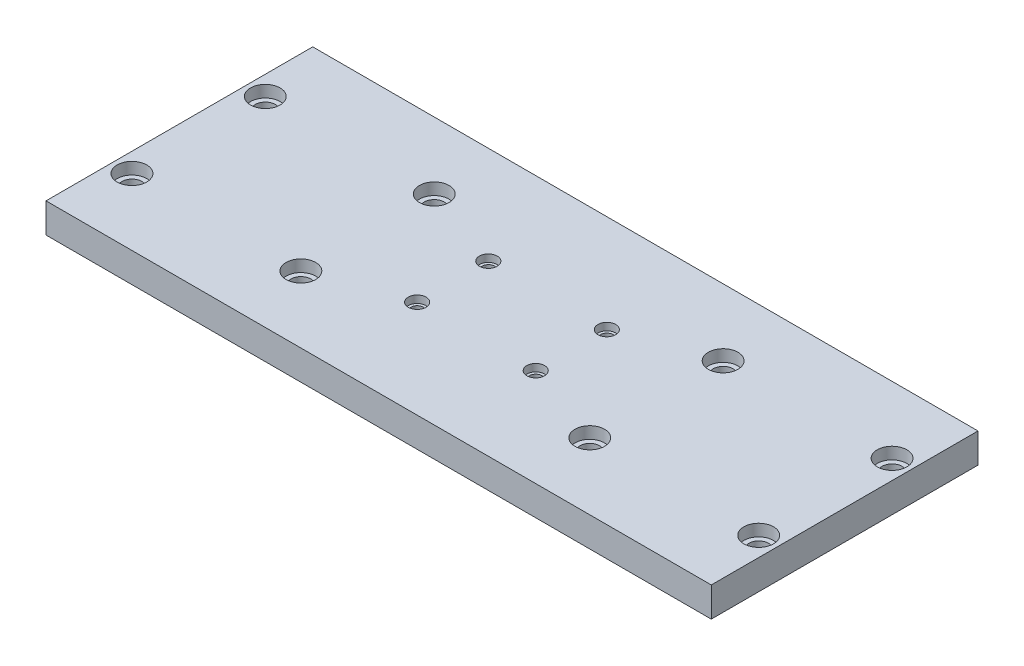
ISO-10303-21;
HEADER;
FILE_DESCRIPTION(('STEP AP214'),'2;1');
FILE_NAME('part.step','',(''),(''),'','','');
FILE_SCHEMA(('AUTOMOTIVE_DESIGN { 1 0 10303 214 1 1 1 1 }'));
ENDSEC;
DATA;
#1=APPLICATION_CONTEXT('core data for automotive mechanical design processes');
#2=APPLICATION_PROTOCOL_DEFINITION('international standard','automotive_design',2000,#1);
#3=PRODUCT_CONTEXT('',#1,'mechanical');
#4=PRODUCT('Part','Part','',(#3));
#5=PRODUCT_RELATED_PRODUCT_CATEGORY('part','',(#4));
#6=PRODUCT_DEFINITION_FORMATION('','',#4);
#7=PRODUCT_DEFINITION_CONTEXT('part definition',#1,'design');
#8=PRODUCT_DEFINITION('design','',#6,#7);
#9=PRODUCT_DEFINITION_SHAPE('','',#8);
#10=(LENGTH_UNIT() NAMED_UNIT(*) SI_UNIT(.MILLI.,.METRE.));
#11=(NAMED_UNIT(*) PLANE_ANGLE_UNIT() SI_UNIT($,.RADIAN.));
#12=(NAMED_UNIT(*) SI_UNIT($,.STERADIAN.) SOLID_ANGLE_UNIT());
#13=UNCERTAINTY_MEASURE_WITH_UNIT(LENGTH_MEASURE(1.E-05),#10,'distance_accuracy_value','');
#14=(GEOMETRIC_REPRESENTATION_CONTEXT(3) GLOBAL_UNCERTAINTY_ASSIGNED_CONTEXT((#13)) GLOBAL_UNIT_ASSIGNED_CONTEXT((#10,
#11,#12)) REPRESENTATION_CONTEXT('',''));
#15=CARTESIAN_POINT('',(0.,0.,0.));
#16=DIRECTION('',(0.,0.,1.));
#17=DIRECTION('',(1.,0.,0.));
#18=AXIS2_PLACEMENT_3D('',#15,#16,#17);
#19=CARTESIAN_POINT('',(-48.7399999999999,0.,-22.5));
#20=DIRECTION('',(0.,1.,0.));
#21=DIRECTION('',(0.,0.,1.));
#22=AXIS2_PLACEMENT_3D('',#19,#20,#21);
#23=CYLINDRICAL_SURFACE('',#22,3.35);
#24=CARTESIAN_POINT('',(-48.7399999999999,0.,-22.5));
#25=DIRECTION('',(0.,1.,0.));
#26=DIRECTION('',(0.,0.,1.));
#27=AXIS2_PLACEMENT_3D('',#24,#25,#26);
#28=CIRCLE('',#27,3.35);
#29=CARTESIAN_POINT('',(-48.7399999999999,0.,-19.15));
#30=VERTEX_POINT('',#29);
#31=EDGE_CURVE('E164',#30,#30,#28,.T.);
#32=ORIENTED_EDGE('',*,*,#31,.F.);
#33=EDGE_LOOP('',(#32));
#34=FACE_BOUND('',#33,.T.);
#35=CARTESIAN_POINT('',(-48.7399999999999,6.,-22.5));
#36=DIRECTION('',(0.,1.,0.));
#37=DIRECTION('',(0.,0.,1.));
#38=AXIS2_PLACEMENT_3D('',#35,#36,#37);
#39=CIRCLE('',#38,3.35);
#40=CARTESIAN_POINT('',(-48.7399999999999,6.,-19.15));
#41=VERTEX_POINT('',#40);
#42=EDGE_CURVE('E40',#41,#41,#39,.F.);
#43=ORIENTED_EDGE('',*,*,#42,.F.);
#44=EDGE_LOOP('',(#43));
#45=FACE_BOUND('',#44,.T.);
#46=ADVANCED_FACE('F36',(#34,#45),#23,.F.);
#47=CARTESIAN_POINT('',(48.74,0.,-22.5));
#48=DIRECTION('',(0.,1.,0.));
#49=DIRECTION('',(0.,0.,1.));
#50=AXIS2_PLACEMENT_3D('',#47,#48,#49);
#51=CYLINDRICAL_SURFACE('',#50,3.35000000000001);
#52=CARTESIAN_POINT('',(48.74,0.,-22.5));
#53=DIRECTION('',(0.,1.,0.));
#54=DIRECTION('',(0.,0.,1.));
#55=AXIS2_PLACEMENT_3D('',#52,#53,#54);
#56=CIRCLE('',#55,3.35000000000001);
#57=CARTESIAN_POINT('',(48.74,0.,-19.15));
#58=VERTEX_POINT('',#57);
#59=EDGE_CURVE('E160',#58,#58,#56,.T.);
#60=ORIENTED_EDGE('',*,*,#59,.F.);
#61=EDGE_LOOP('',(#60));
#62=FACE_BOUND('',#61,.T.);
#63=CARTESIAN_POINT('',(48.74,6.,-22.5));
#64=DIRECTION('',(0.,1.,0.));
#65=DIRECTION('',(0.,0.,1.));
#66=AXIS2_PLACEMENT_3D('',#63,#64,#65);
#67=CIRCLE('',#66,3.35000000000001);
#68=CARTESIAN_POINT('',(48.74,6.,-19.15));
#69=VERTEX_POINT('',#68);
#70=EDGE_CURVE('E146',#69,#69,#67,.F.);
#71=ORIENTED_EDGE('',*,*,#70,.F.);
#72=EDGE_LOOP('',(#71));
#73=FACE_BOUND('',#72,.T.);
#74=ADVANCED_FACE('F274',(#62,#73),#51,.F.);
#75=CARTESIAN_POINT('',(48.7400000000001,0.,22.5));
#76=DIRECTION('',(0.,1.,0.));
#77=DIRECTION('',(0.,0.,1.));
#78=AXIS2_PLACEMENT_3D('',#75,#76,#77);
#79=CYLINDRICAL_SURFACE('',#78,3.35000000000001);
#80=CARTESIAN_POINT('',(48.7400000000001,0.,22.5));
#81=DIRECTION('',(0.,1.,0.));
#82=DIRECTION('',(0.,0.,1.));
#83=AXIS2_PLACEMENT_3D('',#80,#81,#82);
#84=CIRCLE('',#83,3.35000000000001);
#85=CARTESIAN_POINT('',(48.7400000000001,0.,25.85));
#86=VERTEX_POINT('',#85);
#87=EDGE_CURVE('E155',#86,#86,#84,.T.);
#88=ORIENTED_EDGE('',*,*,#87,.F.);
#89=EDGE_LOOP('',(#88));
#90=FACE_BOUND('',#89,.T.);
#91=CARTESIAN_POINT('',(48.7400000000001,6.,22.5));
#92=DIRECTION('',(0.,1.,0.));
#93=DIRECTION('',(0.,0.,1.));
#94=AXIS2_PLACEMENT_3D('',#91,#92,#93);
#95=CIRCLE('',#94,3.35000000000001);
#96=CARTESIAN_POINT('',(48.7400000000001,6.,25.85));
#97=VERTEX_POINT('',#96);
#98=EDGE_CURVE('E143',#97,#97,#95,.F.);
#99=ORIENTED_EDGE('',*,*,#98,.F.);
#100=EDGE_LOOP('',(#99));
#101=FACE_BOUND('',#100,.T.);
#102=ADVANCED_FACE('F280',(#90,#101),#79,.F.);
#103=CARTESIAN_POINT('',(-48.7399999999999,0.,22.5));
#104=DIRECTION('',(0.,1.,0.));
#105=DIRECTION('',(0.,0.,1.));
#106=AXIS2_PLACEMENT_3D('',#103,#104,#105);
#107=CYLINDRICAL_SURFACE('',#106,3.35);
#108=CARTESIAN_POINT('',(-48.7399999999999,0.,22.5));
#109=DIRECTION('',(0.,1.,0.));
#110=DIRECTION('',(0.,0.,1.));
#111=AXIS2_PLACEMENT_3D('',#108,#109,#110);
#112=CIRCLE('',#111,3.35);
#113=CARTESIAN_POINT('',(-48.7399999999999,0.,25.85));
#114=VERTEX_POINT('',#113);
#115=EDGE_CURVE('E151',#114,#114,#112,.T.);
#116=ORIENTED_EDGE('',*,*,#115,.F.);
#117=EDGE_LOOP('',(#116));
#118=FACE_BOUND('',#117,.T.);
#119=CARTESIAN_POINT('',(-48.7399999999999,6.,22.5));
#120=DIRECTION('',(0.,1.,0.));
#121=DIRECTION('',(0.,0.,1.));
#122=AXIS2_PLACEMENT_3D('',#119,#120,#121);
#123=CIRCLE('',#122,3.35);
#124=CARTESIAN_POINT('',(-48.7399999999999,6.,25.85));
#125=VERTEX_POINT('',#124);
#126=EDGE_CURVE('E140',#125,#125,#123,.F.);
#127=ORIENTED_EDGE('',*,*,#126,.F.);
#128=EDGE_LOOP('',(#127));
#129=FACE_BOUND('',#128,.T.);
#130=ADVANCED_FACE('F287',(#118,#129),#107,.F.);
#131=CARTESIAN_POINT('',(20.,10.,-12.));
#132=DIRECTION('',(0.,-1.,0.));
#133=DIRECTION('',(0.,0.,-1.));
#134=AXIS2_PLACEMENT_3D('',#131,#132,#133);
#135=CYLINDRICAL_SURFACE('',#134,2.1);
#136=CARTESIAN_POINT('',(20.,0.,-12.));
#137=DIRECTION('',(0.,1.,0.));
#138=DIRECTION('',(0.,0.,1.));
#139=AXIS2_PLACEMENT_3D('',#136,#137,#138);
#140=CIRCLE('',#139,2.1);
#141=CARTESIAN_POINT('',(20.,0.,-9.89999999999998));
#142=VERTEX_POINT('',#141);
#143=EDGE_CURVE('E215',#142,#142,#140,.T.);
#144=ORIENTED_EDGE('',*,*,#143,.F.);
#145=EDGE_LOOP('',(#144));
#146=FACE_BOUND('',#145,.T.);
#147=CARTESIAN_POINT('',(20.,7.5,-12.));
#148=DIRECTION('',(0.,1.,0.));
#149=DIRECTION('',(0.,0.,1.));
#150=AXIS2_PLACEMENT_3D('',#147,#148,#149);
#151=CIRCLE('',#150,2.1);
#152=CARTESIAN_POINT('',(20.,7.5,-9.89999999999998));
#153=VERTEX_POINT('',#152);
#154=EDGE_CURVE('E136',#153,#153,#151,.T.);
#155=ORIENTED_EDGE('',*,*,#154,.T.);
#156=EDGE_LOOP('',(#155));
#157=FACE_BOUND('',#156,.T.);
#158=ADVANCED_FACE('F347',(#146,#157),#135,.F.);
#159=CARTESIAN_POINT('',(-20.0000000000001,10.,-12.));
#160=DIRECTION('',(0.,-1.,0.));
#161=DIRECTION('',(0.,0.,-1.));
#162=AXIS2_PLACEMENT_3D('',#159,#160,#161);
#163=CYLINDRICAL_SURFACE('',#162,2.1);
#164=CARTESIAN_POINT('',(-20.0000000000001,0.,-12.));
#165=DIRECTION('',(0.,1.,0.));
#166=DIRECTION('',(0.,0.,1.));
#167=AXIS2_PLACEMENT_3D('',#164,#165,#166);
#168=CIRCLE('',#167,2.1);
#169=CARTESIAN_POINT('',(-20.0000000000001,0.,-9.89999999999998));
#170=VERTEX_POINT('',#169);
#171=EDGE_CURVE('E212',#170,#170,#168,.T.);
#172=ORIENTED_EDGE('',*,*,#171,.F.);
#173=EDGE_LOOP('',(#172));
#174=FACE_BOUND('',#173,.T.);
#175=CARTESIAN_POINT('',(-20.0000000000001,7.5,-12.));
#176=DIRECTION('',(0.,1.,0.));
#177=DIRECTION('',(0.,0.,1.));
#178=AXIS2_PLACEMENT_3D('',#175,#176,#177);
#179=CIRCLE('',#178,2.1);
#180=CARTESIAN_POINT('',(-20.0000000000001,7.5,-9.89999999999998));
#181=VERTEX_POINT('',#180);
#182=EDGE_CURVE('E133',#181,#181,#179,.T.);
#183=ORIENTED_EDGE('',*,*,#182,.T.);
#184=EDGE_LOOP('',(#183));
#185=FACE_BOUND('',#184,.T.);
#186=ADVANCED_FACE('F343',(#174,#185),#163,.F.);
#187=CARTESIAN_POINT('',(-20.0000000000001,10.,12.));
#188=DIRECTION('',(0.,-1.,0.));
#189=DIRECTION('',(0.,0.,-1.));
#190=AXIS2_PLACEMENT_3D('',#187,#188,#189);
#191=CYLINDRICAL_SURFACE('',#190,2.1);
#192=CARTESIAN_POINT('',(-20.0000000000001,0.,12.));
#193=DIRECTION('',(0.,1.,0.));
#194=DIRECTION('',(0.,0.,1.));
#195=AXIS2_PLACEMENT_3D('',#192,#193,#194);
#196=CIRCLE('',#195,2.1);
#197=CARTESIAN_POINT('',(-20.0000000000001,0.,14.1));
#198=VERTEX_POINT('',#197);
#199=EDGE_CURVE('E216',#198,#198,#196,.T.);
#200=ORIENTED_EDGE('',*,*,#199,.F.);
#201=EDGE_LOOP('',(#200));
#202=FACE_BOUND('',#201,.T.);
#203=CARTESIAN_POINT('',(-20.0000000000001,7.5,12.));
#204=DIRECTION('',(0.,1.,0.));
#205=DIRECTION('',(0.,0.,1.));
#206=AXIS2_PLACEMENT_3D('',#203,#204,#205);
#207=CIRCLE('',#206,2.1);
#208=CARTESIAN_POINT('',(-20.0000000000001,7.5,14.1));
#209=VERTEX_POINT('',#208);
#210=EDGE_CURVE('E129',#209,#209,#207,.T.);
#211=ORIENTED_EDGE('',*,*,#210,.T.);
#212=EDGE_LOOP('',(#211));
#213=FACE_BOUND('',#212,.T.);
#214=ADVANCED_FACE('F346',(#202,#213),#191,.F.);
#215=CARTESIAN_POINT('',(20.,10.,12.));
#216=DIRECTION('',(0.,-1.,0.));
#217=DIRECTION('',(0.,0.,-1.));
#218=AXIS2_PLACEMENT_3D('',#215,#216,#217);
#219=CYLINDRICAL_SURFACE('',#218,2.1);
#220=CARTESIAN_POINT('',(20.,0.,12.));
#221=DIRECTION('',(0.,1.,0.));
#222=DIRECTION('',(0.,0.,1.));
#223=AXIS2_PLACEMENT_3D('',#220,#221,#222);
#224=CIRCLE('',#223,2.1);
#225=CARTESIAN_POINT('',(20.,0.,14.1));
#226=VERTEX_POINT('',#225);
#227=EDGE_CURVE('E125',#226,#226,#224,.T.);
#228=ORIENTED_EDGE('',*,*,#227,.F.);
#229=EDGE_LOOP('',(#228));
#230=FACE_BOUND('',#229,.T.);
#231=CARTESIAN_POINT('',(20.,7.5,12.));
#232=DIRECTION('',(0.,1.,0.));
#233=DIRECTION('',(0.,0.,1.));
#234=AXIS2_PLACEMENT_3D('',#231,#232,#233);
#235=CIRCLE('',#234,2.1);
#236=CARTESIAN_POINT('',(20.,7.5,14.1));
#237=VERTEX_POINT('',#236);
#238=EDGE_CURVE('E126',#237,#237,#235,.T.);
#239=ORIENTED_EDGE('',*,*,#238,.T.);
#240=EDGE_LOOP('',(#239));
#241=FACE_BOUND('',#240,.T.);
#242=ADVANCED_FACE('F242',(#230,#241),#219,.F.);
#243=CARTESIAN_POINT('',(-105.74,10.,-22.5));
#244=DIRECTION('',(0.,-1.,0.));
#245=DIRECTION('',(0.,0.,-1.));
#246=AXIS2_PLACEMENT_3D('',#243,#244,#245);
#247=CYLINDRICAL_SURFACE('',#246,3.35);
#248=CARTESIAN_POINT('',(-105.74,0.,-22.5));
#249=DIRECTION('',(0.,1.,0.));
#250=DIRECTION('',(0.,0.,1.));
#251=AXIS2_PLACEMENT_3D('',#248,#249,#250);
#252=CIRCLE('',#251,3.35);
#253=CARTESIAN_POINT('',(-105.74,0.,-19.15));
#254=VERTEX_POINT('',#253);
#255=EDGE_CURVE('E106',#254,#254,#252,.T.);
#256=ORIENTED_EDGE('',*,*,#255,.F.);
#257=EDGE_LOOP('',(#256));
#258=FACE_BOUND('',#257,.T.);
#259=CARTESIAN_POINT('',(-105.74,6.,-22.5));
#260=DIRECTION('',(0.,1.,0.));
#261=DIRECTION('',(0.,0.,1.));
#262=AXIS2_PLACEMENT_3D('',#259,#260,#261);
#263=CIRCLE('',#262,3.35);
#264=CARTESIAN_POINT('',(-105.74,6.,-19.15));
#265=VERTEX_POINT('',#264);
#266=EDGE_CURVE('E122',#265,#265,#263,.T.);
#267=ORIENTED_EDGE('',*,*,#266,.T.);
#268=EDGE_LOOP('',(#267));
#269=FACE_BOUND('',#268,.T.);
#270=ADVANCED_FACE('F238',(#258,#269),#247,.F.);
#271=CARTESIAN_POINT('',(105.74,10.,-22.5));
#272=DIRECTION('',(0.,-1.,0.));
#273=DIRECTION('',(0.,0.,-1.));
#274=AXIS2_PLACEMENT_3D('',#271,#272,#273);
#275=CYLINDRICAL_SURFACE('',#274,3.35);
#276=CARTESIAN_POINT('',(105.74,0.,-22.5));
#277=DIRECTION('',(0.,1.,0.));
#278=DIRECTION('',(0.,0.,1.));
#279=AXIS2_PLACEMENT_3D('',#276,#277,#278);
#280=CIRCLE('',#279,3.35);
#281=CARTESIAN_POINT('',(105.74,0.,-19.15));
#282=VERTEX_POINT('',#281);
#283=EDGE_CURVE('E224',#282,#282,#280,.T.);
#284=ORIENTED_EDGE('',*,*,#283,.F.);
#285=EDGE_LOOP('',(#284));
#286=FACE_BOUND('',#285,.T.);
#287=CARTESIAN_POINT('',(105.74,6.,-22.5));
#288=DIRECTION('',(0.,1.,0.));
#289=DIRECTION('',(0.,0.,1.));
#290=AXIS2_PLACEMENT_3D('',#287,#288,#289);
#291=CIRCLE('',#290,3.35);
#292=CARTESIAN_POINT('',(105.74,6.,-19.15));
#293=VERTEX_POINT('',#292);
#294=EDGE_CURVE('E119',#293,#293,#291,.T.);
#295=ORIENTED_EDGE('',*,*,#294,.T.);
#296=EDGE_LOOP('',(#295));
#297=FACE_BOUND('',#296,.T.);
#298=ADVANCED_FACE('F241',(#286,#297),#275,.F.);
#299=CARTESIAN_POINT('',(105.74,10.,22.5));
#300=DIRECTION('',(0.,-1.,0.));
#301=DIRECTION('',(0.,0.,-1.));
#302=AXIS2_PLACEMENT_3D('',#299,#300,#301);
#303=CYLINDRICAL_SURFACE('',#302,3.35);
#304=CARTESIAN_POINT('',(105.74,0.,22.5));
#305=DIRECTION('',(0.,1.,0.));
#306=DIRECTION('',(0.,0.,1.));
#307=AXIS2_PLACEMENT_3D('',#304,#305,#306);
#308=CIRCLE('',#307,3.35);
#309=CARTESIAN_POINT('',(105.74,0.,25.85));
#310=VERTEX_POINT('',#309);
#311=EDGE_CURVE('E227',#310,#310,#308,.T.);
#312=ORIENTED_EDGE('',*,*,#311,.F.);
#313=EDGE_LOOP('',(#312));
#314=FACE_BOUND('',#313,.T.);
#315=CARTESIAN_POINT('',(105.74,6.,22.5));
#316=DIRECTION('',(0.,1.,0.));
#317=DIRECTION('',(0.,0.,1.));
#318=AXIS2_PLACEMENT_3D('',#315,#316,#317);
#319=CIRCLE('',#318,3.35);
#320=CARTESIAN_POINT('',(105.74,6.,25.85));
#321=VERTEX_POINT('',#320);
#322=EDGE_CURVE('E115',#321,#321,#319,.T.);
#323=ORIENTED_EDGE('',*,*,#322,.T.);
#324=EDGE_LOOP('',(#323));
#325=FACE_BOUND('',#324,.T.);
#326=ADVANCED_FACE('F360',(#314,#325),#303,.F.);
#327=CARTESIAN_POINT('',(-105.74,10.,22.5));
#328=DIRECTION('',(0.,-1.,0.));
#329=DIRECTION('',(0.,0.,-1.));
#330=AXIS2_PLACEMENT_3D('',#327,#328,#329);
#331=CYLINDRICAL_SURFACE('',#330,3.35);
#332=CARTESIAN_POINT('',(-105.74,0.,22.5));
#333=DIRECTION('',(0.,1.,0.));
#334=DIRECTION('',(0.,0.,1.));
#335=AXIS2_PLACEMENT_3D('',#332,#333,#334);
#336=CIRCLE('',#335,3.35);
#337=CARTESIAN_POINT('',(-105.74,0.,25.85));
#338=VERTEX_POINT('',#337);
#339=EDGE_CURVE('E223',#338,#338,#336,.T.);
#340=ORIENTED_EDGE('',*,*,#339,.F.);
#341=EDGE_LOOP('',(#340));
#342=FACE_BOUND('',#341,.T.);
#343=CARTESIAN_POINT('',(-105.74,6.,22.5));
#344=DIRECTION('',(0.,1.,0.));
#345=DIRECTION('',(0.,0.,1.));
#346=AXIS2_PLACEMENT_3D('',#343,#344,#345);
#347=CIRCLE('',#346,3.35);
#348=CARTESIAN_POINT('',(-105.74,6.,25.85));
#349=VERTEX_POINT('',#348);
#350=EDGE_CURVE('E112',#349,#349,#347,.T.);
#351=ORIENTED_EDGE('',*,*,#350,.T.);
#352=EDGE_LOOP('',(#351));
#353=FACE_BOUND('',#352,.T.);
#354=ADVANCED_FACE('F364',(#342,#353),#331,.F.);
#355=CARTESIAN_POINT('',(112.24,10.,45.));
#356=DIRECTION('',(-1.,0.,0.));
#357=DIRECTION('',(0.,0.,1.));
#358=AXIS2_PLACEMENT_3D('',#355,#356,#357);
#359=PLANE('',#358);
#360=DIRECTION('',(0.,0.,-1.));
#361=VECTOR('',#360,1.);
#362=CARTESIAN_POINT('',(112.24,0.,45.));
#363=LINE('',#362,#361);
#364=CARTESIAN_POINT('',(112.24,0.,45.));
#365=VERTEX_POINT('',#364);
#366=CARTESIAN_POINT('',(112.24,0.,-45.));
#367=VERTEX_POINT('',#366);
#368=EDGE_CURVE('E103',#365,#367,#363,.T.);
#369=ORIENTED_EDGE('',*,*,#368,.T.);
#370=DIRECTION('',(0.,-1.,0.));
#371=VECTOR('',#370,1.);
#372=CARTESIAN_POINT('',(112.24,10.,-45.));
#373=LINE('',#372,#371);
#374=CARTESIAN_POINT('',(112.24,10.,-45.));
#375=VERTEX_POINT('',#374);
#376=EDGE_CURVE('E11',#375,#367,#373,.T.);
#377=ORIENTED_EDGE('',*,*,#376,.F.);
#378=DIRECTION('',(0.,0.,-1.));
#379=VECTOR('',#378,1.);
#380=CARTESIAN_POINT('',(112.24,10.,45.));
#381=LINE('',#380,#379);
#382=CARTESIAN_POINT('',(112.24,10.,45.));
#383=VERTEX_POINT('',#382);
#384=EDGE_CURVE('E90',#383,#375,#381,.T.);
#385=ORIENTED_EDGE('',*,*,#384,.F.);
#386=DIRECTION('',(0.,-1.,0.));
#387=VECTOR('',#386,1.);
#388=CARTESIAN_POINT('',(112.24,10.,45.));
#389=LINE('',#388,#387);
#390=EDGE_CURVE('E99',#383,#365,#389,.T.);
#391=ORIENTED_EDGE('',*,*,#390,.T.);
#392=EDGE_LOOP('',(#369,#377,#385,#391));
#393=FACE_BOUND('',#392,.T.);
#394=ADVANCED_FACE('F38',(#393),#359,.F.);
#395=CARTESIAN_POINT('',(-112.24,10.,-45.));
#396=DIRECTION('',(0.,0.,1.));
#397=DIRECTION('',(1.,0.,0.));
#398=AXIS2_PLACEMENT_3D('',#395,#396,#397);
#399=PLANE('',#398);
#400=DIRECTION('',(-1.,0.,0.));
#401=VECTOR('',#400,1.);
#402=CARTESIAN_POINT('',(-112.24,0.,-45.));
#403=LINE('',#402,#401);
#404=CARTESIAN_POINT('',(-112.24,0.,-45.));
#405=VERTEX_POINT('',#404);
#406=EDGE_CURVE('E94',#367,#405,#403,.T.);
#407=ORIENTED_EDGE('',*,*,#406,.T.);
#408=DIRECTION('',(0.,-1.,0.));
#409=VECTOR('',#408,1.);
#410=CARTESIAN_POINT('',(-112.24,10.,-45.));
#411=LINE('',#410,#409);
#412=CARTESIAN_POINT('',(-112.24,10.,-45.));
#413=VERTEX_POINT('',#412);
#414=EDGE_CURVE('E46',#413,#405,#411,.T.);
#415=ORIENTED_EDGE('',*,*,#414,.F.);
#416=DIRECTION('',(-1.,0.,0.));
#417=VECTOR('',#416,1.);
#418=CARTESIAN_POINT('',(-112.24,10.,-45.));
#419=LINE('',#418,#417);
#420=EDGE_CURVE('E85',#375,#413,#419,.T.);
#421=ORIENTED_EDGE('',*,*,#420,.F.);
#422=ORIENTED_EDGE('',*,*,#376,.T.);
#423=EDGE_LOOP('',(#407,#415,#421,#422));
#424=FACE_BOUND('',#423,.T.);
#425=ADVANCED_FACE('F93',(#424),#399,.F.);
#426=CARTESIAN_POINT('',(-112.24,10.,45.));
#427=DIRECTION('',(1.,0.,0.));
#428=DIRECTION('',(0.,0.,-1.));
#429=AXIS2_PLACEMENT_3D('',#426,#427,#428);
#430=PLANE('',#429);
#431=DIRECTION('',(0.,0.,1.));
#432=VECTOR('',#431,1.);
#433=CARTESIAN_POINT('',(-112.24,0.,45.));
#434=LINE('',#433,#432);
#435=CARTESIAN_POINT('',(-112.24,0.,45.));
#436=VERTEX_POINT('',#435);
#437=EDGE_CURVE('E72',#405,#436,#434,.T.);
#438=ORIENTED_EDGE('',*,*,#437,.T.);
#439=DIRECTION('',(0.,-1.,0.));
#440=VECTOR('',#439,1.);
#441=CARTESIAN_POINT('',(-112.24,10.,45.));
#442=LINE('',#441,#440);
#443=CARTESIAN_POINT('',(-112.24,10.,45.));
#444=VERTEX_POINT('',#443);
#445=EDGE_CURVE('E95',#444,#436,#442,.T.);
#446=ORIENTED_EDGE('',*,*,#445,.F.);
#447=DIRECTION('',(0.,0.,1.));
#448=VECTOR('',#447,1.);
#449=CARTESIAN_POINT('',(-112.24,10.,45.));
#450=LINE('',#449,#448);
#451=EDGE_CURVE('E88',#413,#444,#450,.T.);
#452=ORIENTED_EDGE('',*,*,#451,.F.);
#453=ORIENTED_EDGE('',*,*,#414,.T.);
#454=EDGE_LOOP('',(#438,#446,#452,#453));
#455=FACE_BOUND('',#454,.T.);
#456=ADVANCED_FACE('F97',(#455),#430,.F.);
#457=CARTESIAN_POINT('',(-112.24,10.,45.));
#458=DIRECTION('',(0.,0.,-1.));
#459=DIRECTION('',(-1.,0.,0.));
#460=AXIS2_PLACEMENT_3D('',#457,#458,#459);
#461=PLANE('',#460);
#462=DIRECTION('',(1.,0.,0.));
#463=VECTOR('',#462,1.);
#464=CARTESIAN_POINT('',(-112.24,0.,45.));
#465=LINE('',#464,#463);
#466=EDGE_CURVE('E78',#436,#365,#465,.T.);
#467=ORIENTED_EDGE('',*,*,#466,.T.);
#468=ORIENTED_EDGE('',*,*,#390,.F.);
#469=DIRECTION('',(1.,0.,0.));
#470=VECTOR('',#469,1.);
#471=CARTESIAN_POINT('',(-112.24,10.,45.));
#472=LINE('',#471,#470);
#473=EDGE_CURVE('E55',#444,#383,#472,.T.);
#474=ORIENTED_EDGE('',*,*,#473,.F.);
#475=ORIENTED_EDGE('',*,*,#445,.T.);
#476=EDGE_LOOP('',(#467,#468,#474,#475));
#477=FACE_BOUND('',#476,.T.);
#478=ADVANCED_FACE('F261',(#477),#461,.F.);
#479=CARTESIAN_POINT('',(0.,10.,0.));
#480=DIRECTION('',(0.,-1.,0.));
#481=DIRECTION('',(0.,0.,-1.));
#482=AXIS2_PLACEMENT_3D('',#479,#480,#481);
#483=PLANE('',#482);
#484=CARTESIAN_POINT('',(48.74,10.,-22.5));
#485=DIRECTION('',(0.,1.,0.));
#486=DIRECTION('',(0.,0.,1.));
#487=AXIS2_PLACEMENT_3D('',#484,#485,#486);
#488=CIRCLE('',#487,5.);
#489=CARTESIAN_POINT('',(48.74,10.,-17.5));
#490=VERTEX_POINT('',#489);
#491=EDGE_CURVE('E729',#490,#490,#488,.T.);
#492=ORIENTED_EDGE('',*,*,#491,.F.);
#493=EDGE_LOOP('',(#492));
#494=FACE_BOUND('',#493,.T.);
#495=CARTESIAN_POINT('',(48.7400000000001,10.,22.5));
#496=DIRECTION('',(0.,1.,0.));
#497=DIRECTION('',(0.,0.,1.));
#498=AXIS2_PLACEMENT_3D('',#495,#496,#497);
#499=CIRCLE('',#498,5.);
#500=CARTESIAN_POINT('',(48.7400000000001,10.,27.5));
#501=VERTEX_POINT('',#500);
#502=EDGE_CURVE('E735',#501,#501,#499,.T.);
#503=ORIENTED_EDGE('',*,*,#502,.F.);
#504=EDGE_LOOP('',(#503));
#505=FACE_BOUND('',#504,.T.);
#506=CARTESIAN_POINT('',(-48.7399999999999,10.,22.5));
#507=DIRECTION('',(0.,1.,0.));
#508=DIRECTION('',(0.,0.,1.));
#509=AXIS2_PLACEMENT_3D('',#506,#507,#508);
#510=CIRCLE('',#509,5.);
#511=CARTESIAN_POINT('',(-48.7399999999999,10.,27.5));
#512=VERTEX_POINT('',#511);
#513=EDGE_CURVE('E685',#512,#512,#510,.T.);
#514=ORIENTED_EDGE('',*,*,#513,.F.);
#515=EDGE_LOOP('',(#514));
#516=FACE_BOUND('',#515,.T.);
#517=CARTESIAN_POINT('',(-48.7399999999999,10.,-22.5));
#518=DIRECTION('',(0.,1.,0.));
#519=DIRECTION('',(0.,0.,1.));
#520=AXIS2_PLACEMENT_3D('',#517,#518,#519);
#521=CIRCLE('',#520,5.);
#522=CARTESIAN_POINT('',(-48.7399999999999,10.,-17.5));
#523=VERTEX_POINT('',#522);
#524=EDGE_CURVE('E679',#523,#523,#521,.T.);
#525=ORIENTED_EDGE('',*,*,#524,.F.);
#526=EDGE_LOOP('',(#525));
#527=FACE_BOUND('',#526,.T.);
#528=CARTESIAN_POINT('',(-20.0000000000001,10.,12.));
#529=DIRECTION('',(0.,1.,0.));
#530=DIRECTION('',(0.,0.,1.));
#531=AXIS2_PLACEMENT_3D('',#528,#529,#530);
#532=CIRCLE('',#531,3.);
#533=CARTESIAN_POINT('',(-20.0000000000001,10.,15.));
#534=VERTEX_POINT('',#533);
#535=EDGE_CURVE('E167',#534,#534,#532,.T.);
#536=ORIENTED_EDGE('',*,*,#535,.F.);
#537=EDGE_LOOP('',(#536));
#538=FACE_BOUND('',#537,.T.);
#539=CARTESIAN_POINT('',(20.,10.,12.));
#540=DIRECTION('',(0.,1.,0.));
#541=DIRECTION('',(0.,0.,1.));
#542=AXIS2_PLACEMENT_3D('',#539,#540,#541);
#543=CIRCLE('',#542,3.);
#544=CARTESIAN_POINT('',(20.,10.,15.));
#545=VERTEX_POINT('',#544);
#546=EDGE_CURVE('E178',#545,#545,#543,.T.);
#547=ORIENTED_EDGE('',*,*,#546,.F.);
#548=EDGE_LOOP('',(#547));
#549=FACE_BOUND('',#548,.T.);
#550=CARTESIAN_POINT('',(20.,10.,-12.));
#551=DIRECTION('',(0.,1.,0.));
#552=DIRECTION('',(0.,0.,1.));
#553=AXIS2_PLACEMENT_3D('',#550,#551,#552);
#554=CIRCLE('',#553,3.);
#555=CARTESIAN_POINT('',(20.,10.,-8.99999999999998));
#556=VERTEX_POINT('',#555);
#557=EDGE_CURVE('E172',#556,#556,#554,.T.);
#558=ORIENTED_EDGE('',*,*,#557,.F.);
#559=EDGE_LOOP('',(#558));
#560=FACE_BOUND('',#559,.T.);
#561=CARTESIAN_POINT('',(-20.0000000000001,10.,-12.));
#562=DIRECTION('',(0.,1.,0.));
#563=DIRECTION('',(0.,0.,1.));
#564=AXIS2_PLACEMENT_3D('',#561,#562,#563);
#565=CIRCLE('',#564,3.);
#566=CARTESIAN_POINT('',(-20.0000000000001,10.,-8.99999999999998));
#567=VERTEX_POINT('',#566);
#568=EDGE_CURVE('E171',#567,#567,#565,.T.);
#569=ORIENTED_EDGE('',*,*,#568,.F.);
#570=EDGE_LOOP('',(#569));
#571=FACE_BOUND('',#570,.T.);
#572=CARTESIAN_POINT('',(-105.74,10.,22.5));
#573=DIRECTION('',(0.,1.,0.));
#574=DIRECTION('',(0.,0.,1.));
#575=AXIS2_PLACEMENT_3D('',#572,#573,#574);
#576=CIRCLE('',#575,4.99999999999999);
#577=CARTESIAN_POINT('',(-105.74,10.,27.5));
#578=VERTEX_POINT('',#577);
#579=EDGE_CURVE('E200',#578,#578,#576,.T.);
#580=ORIENTED_EDGE('',*,*,#579,.F.);
#581=EDGE_LOOP('',(#580));
#582=FACE_BOUND('',#581,.T.);
#583=CARTESIAN_POINT('',(105.74,10.,-22.5));
#584=DIRECTION('',(0.,1.,0.));
#585=DIRECTION('',(0.,0.,1.));
#586=AXIS2_PLACEMENT_3D('',#583,#584,#585);
#587=CIRCLE('',#586,4.99999999999999);
#588=CARTESIAN_POINT('',(105.74,10.,-17.5));
#589=VERTEX_POINT('',#588);
#590=EDGE_CURVE('E193',#589,#589,#587,.T.);
#591=ORIENTED_EDGE('',*,*,#590,.F.);
#592=EDGE_LOOP('',(#591));
#593=FACE_BOUND('',#592,.T.);
#594=CARTESIAN_POINT('',(105.74,10.,22.5));
#595=DIRECTION('',(0.,1.,0.));
#596=DIRECTION('',(0.,0.,1.));
#597=AXIS2_PLACEMENT_3D('',#594,#595,#596);
#598=CIRCLE('',#597,4.99999999999999);
#599=CARTESIAN_POINT('',(105.74,10.,27.5));
#600=VERTEX_POINT('',#599);
#601=EDGE_CURVE('E139',#600,#600,#598,.T.);
#602=ORIENTED_EDGE('',*,*,#601,.F.);
#603=EDGE_LOOP('',(#602));
#604=FACE_BOUND('',#603,.T.);
#605=CARTESIAN_POINT('',(-105.74,10.,-22.5));
#606=DIRECTION('',(0.,1.,0.));
#607=DIRECTION('',(0.,0.,1.));
#608=AXIS2_PLACEMENT_3D('',#605,#606,#607);
#609=CIRCLE('',#608,4.99999999999999);
#610=CARTESIAN_POINT('',(-105.74,10.,-17.5));
#611=VERTEX_POINT('',#610);
#612=EDGE_CURVE('E199',#611,#611,#609,.T.);
#613=ORIENTED_EDGE('',*,*,#612,.F.);
#614=EDGE_LOOP('',(#613));
#615=FACE_BOUND('',#614,.T.);
#616=ORIENTED_EDGE('',*,*,#384,.T.);
#617=ORIENTED_EDGE('',*,*,#420,.T.);
#618=ORIENTED_EDGE('',*,*,#451,.T.);
#619=ORIENTED_EDGE('',*,*,#473,.T.);
#620=EDGE_LOOP('',(#616,#617,#618,#619));
#621=FACE_BOUND('',#620,.T.);
#622=ADVANCED_FACE('F86',(#494,#505,#516,#527,#538,#549,#560,#571,#582,#593,#604,#615,#621),
#483,.F.);
#623=CARTESIAN_POINT('',(0.,0.,0.));
#624=DIRECTION('',(0.,-1.,0.));
#625=DIRECTION('',(0.,0.,-1.));
#626=AXIS2_PLACEMENT_3D('',#623,#624,#625);
#627=PLANE('',#626);
#628=ORIENTED_EDGE('',*,*,#115,.T.);
#629=EDGE_LOOP('',(#628));
#630=FACE_BOUND('',#629,.T.);
#631=ORIENTED_EDGE('',*,*,#87,.T.);
#632=EDGE_LOOP('',(#631));
#633=FACE_BOUND('',#632,.T.);
#634=ORIENTED_EDGE('',*,*,#59,.T.);
#635=EDGE_LOOP('',(#634));
#636=FACE_BOUND('',#635,.T.);
#637=ORIENTED_EDGE('',*,*,#31,.T.);
#638=EDGE_LOOP('',(#637));
#639=FACE_BOUND('',#638,.T.);
#640=ORIENTED_EDGE('',*,*,#227,.T.);
#641=EDGE_LOOP('',(#640));
#642=FACE_BOUND('',#641,.T.);
#643=ORIENTED_EDGE('',*,*,#199,.T.);
#644=EDGE_LOOP('',(#643));
#645=FACE_BOUND('',#644,.T.);
#646=ORIENTED_EDGE('',*,*,#171,.T.);
#647=EDGE_LOOP('',(#646));
#648=FACE_BOUND('',#647,.T.);
#649=ORIENTED_EDGE('',*,*,#143,.T.);
#650=EDGE_LOOP('',(#649));
#651=FACE_BOUND('',#650,.T.);
#652=ORIENTED_EDGE('',*,*,#339,.T.);
#653=EDGE_LOOP('',(#652));
#654=FACE_BOUND('',#653,.T.);
#655=ORIENTED_EDGE('',*,*,#311,.T.);
#656=EDGE_LOOP('',(#655));
#657=FACE_BOUND('',#656,.T.);
#658=ORIENTED_EDGE('',*,*,#283,.T.);
#659=EDGE_LOOP('',(#658));
#660=FACE_BOUND('',#659,.T.);
#661=ORIENTED_EDGE('',*,*,#255,.T.);
#662=EDGE_LOOP('',(#661));
#663=FACE_BOUND('',#662,.T.);
#664=ORIENTED_EDGE('',*,*,#368,.F.);
#665=ORIENTED_EDGE('',*,*,#466,.F.);
#666=ORIENTED_EDGE('',*,*,#437,.F.);
#667=ORIENTED_EDGE('',*,*,#406,.F.);
#668=EDGE_LOOP('',(#664,#665,#666,#667));
#669=FACE_BOUND('',#668,.T.);
#670=ADVANCED_FACE('F235',(#630,#633,#636,#639,#642,#645,#648,#651,#654,#657,#660,#663,#669),
#627,.T.);
#671=CARTESIAN_POINT('',(-105.74,6.,22.5));
#672=DIRECTION('',(0.,1.,0.));
#673=DIRECTION('',(0.,0.,1.));
#674=AXIS2_PLACEMENT_3D('',#671,#672,#673);
#675=CYLINDRICAL_SURFACE('',#674,4.99999999999999);
#676=CARTESIAN_POINT('',(-105.74,6.,22.5));
#677=DIRECTION('',(0.,1.,0.));
#678=DIRECTION('',(0.,0.,1.));
#679=AXIS2_PLACEMENT_3D('',#676,#677,#678);
#680=CIRCLE('',#679,4.99999999999999);
#681=CARTESIAN_POINT('',(-105.74,6.,27.5));
#682=VERTEX_POINT('',#681);
#683=EDGE_CURVE('E196',#682,#682,#680,.T.);
#684=ORIENTED_EDGE('',*,*,#683,.F.);
#685=EDGE_LOOP('',(#684));
#686=FACE_BOUND('',#685,.T.);
#687=ORIENTED_EDGE('',*,*,#579,.T.);
#688=EDGE_LOOP('',(#687));
#689=FACE_BOUND('',#688,.T.);
#690=ADVANCED_FACE('F268',(#686,#689),#675,.F.);
#691=CARTESIAN_POINT('',(-105.74,6.,22.5));
#692=DIRECTION('',(0.,1.,0.));
#693=DIRECTION('',(0.,0.,1.));
#694=AXIS2_PLACEMENT_3D('',#691,#692,#693);
#695=PLANE('',#694);
#696=ORIENTED_EDGE('',*,*,#350,.F.);
#697=EDGE_LOOP('',(#696));
#698=FACE_BOUND('',#697,.T.);
#699=ORIENTED_EDGE('',*,*,#683,.T.);
#700=EDGE_LOOP('',(#699));
#701=FACE_BOUND('',#700,.T.);
#702=ADVANCED_FACE('F329',(#698,#701),#695,.T.);
#703=CARTESIAN_POINT('',(105.74,6.,22.5));
#704=DIRECTION('',(0.,1.,0.));
#705=DIRECTION('',(0.,0.,1.));
#706=AXIS2_PLACEMENT_3D('',#703,#704,#705);
#707=CYLINDRICAL_SURFACE('',#706,4.99999999999999);
#708=CARTESIAN_POINT('',(105.74,6.,22.5));
#709=DIRECTION('',(0.,1.,0.));
#710=DIRECTION('',(0.,0.,1.));
#711=AXIS2_PLACEMENT_3D('',#708,#709,#710);
#712=CIRCLE('',#711,4.99999999999999);
#713=CARTESIAN_POINT('',(105.74,6.,27.5));
#714=VERTEX_POINT('',#713);
#715=EDGE_CURVE('E190',#714,#714,#712,.T.);
#716=ORIENTED_EDGE('',*,*,#715,.F.);
#717=EDGE_LOOP('',(#716));
#718=FACE_BOUND('',#717,.T.);
#719=ORIENTED_EDGE('',*,*,#601,.T.);
#720=EDGE_LOOP('',(#719));
#721=FACE_BOUND('',#720,.T.);
#722=ADVANCED_FACE('F325',(#718,#721),#707,.F.);
#723=CARTESIAN_POINT('',(105.74,6.,22.5));
#724=DIRECTION('',(0.,1.,0.));
#725=DIRECTION('',(0.,0.,1.));
#726=AXIS2_PLACEMENT_3D('',#723,#724,#725);
#727=PLANE('',#726);
#728=ORIENTED_EDGE('',*,*,#322,.F.);
#729=EDGE_LOOP('',(#728));
#730=FACE_BOUND('',#729,.T.);
#731=ORIENTED_EDGE('',*,*,#715,.T.);
#732=EDGE_LOOP('',(#731));
#733=FACE_BOUND('',#732,.T.);
#734=ADVANCED_FACE('F321',(#730,#733),#727,.T.);
#735=CARTESIAN_POINT('',(105.74,6.,-22.5));
#736=DIRECTION('',(0.,1.,0.));
#737=DIRECTION('',(0.,0.,1.));
#738=AXIS2_PLACEMENT_3D('',#735,#736,#737);
#739=CYLINDRICAL_SURFACE('',#738,4.99999999999999);
#740=CARTESIAN_POINT('',(105.74,6.,-22.5));
#741=DIRECTION('',(0.,1.,0.));
#742=DIRECTION('',(0.,0.,1.));
#743=AXIS2_PLACEMENT_3D('',#740,#741,#742);
#744=CIRCLE('',#743,4.99999999999999);
#745=CARTESIAN_POINT('',(105.74,6.,-17.5));
#746=VERTEX_POINT('',#745);
#747=EDGE_CURVE('E203',#746,#746,#744,.T.);
#748=ORIENTED_EDGE('',*,*,#747,.F.);
#749=EDGE_LOOP('',(#748));
#750=FACE_BOUND('',#749,.T.);
#751=ORIENTED_EDGE('',*,*,#590,.T.);
#752=EDGE_LOOP('',(#751));
#753=FACE_BOUND('',#752,.T.);
#754=ADVANCED_FACE('F324',(#750,#753),#739,.F.);
#755=CARTESIAN_POINT('',(105.74,6.,-22.5));
#756=DIRECTION('',(0.,1.,0.));
#757=DIRECTION('',(0.,0.,1.));
#758=AXIS2_PLACEMENT_3D('',#755,#756,#757);
#759=PLANE('',#758);
#760=ORIENTED_EDGE('',*,*,#294,.F.);
#761=EDGE_LOOP('',(#760));
#762=FACE_BOUND('',#761,.T.);
#763=ORIENTED_EDGE('',*,*,#747,.T.);
#764=EDGE_LOOP('',(#763));
#765=FACE_BOUND('',#764,.T.);
#766=ADVANCED_FACE('F256',(#762,#765),#759,.T.);
#767=CARTESIAN_POINT('',(-105.74,6.,-22.5));
#768=DIRECTION('',(0.,1.,0.));
#769=DIRECTION('',(0.,0.,1.));
#770=AXIS2_PLACEMENT_3D('',#767,#768,#769);
#771=CYLINDRICAL_SURFACE('',#770,4.99999999999999);
#772=CARTESIAN_POINT('',(-105.74,6.,-22.5));
#773=DIRECTION('',(0.,1.,0.));
#774=DIRECTION('',(0.,0.,1.));
#775=AXIS2_PLACEMENT_3D('',#772,#773,#774);
#776=CIRCLE('',#775,4.99999999999999);
#777=CARTESIAN_POINT('',(-105.74,6.,-17.5));
#778=VERTEX_POINT('',#777);
#779=EDGE_CURVE('E116',#778,#778,#776,.T.);
#780=ORIENTED_EDGE('',*,*,#779,.F.);
#781=EDGE_LOOP('',(#780));
#782=FACE_BOUND('',#781,.T.);
#783=ORIENTED_EDGE('',*,*,#612,.T.);
#784=EDGE_LOOP('',(#783));
#785=FACE_BOUND('',#784,.T.);
#786=ADVANCED_FACE('F250',(#782,#785),#771,.F.);
#787=CARTESIAN_POINT('',(-105.74,6.,-22.5));
#788=DIRECTION('',(0.,1.,0.));
#789=DIRECTION('',(0.,0.,1.));
#790=AXIS2_PLACEMENT_3D('',#787,#788,#789);
#791=PLANE('',#790);
#792=ORIENTED_EDGE('',*,*,#266,.F.);
#793=EDGE_LOOP('',(#792));
#794=FACE_BOUND('',#793,.T.);
#795=ORIENTED_EDGE('',*,*,#779,.T.);
#796=EDGE_LOOP('',(#795));
#797=FACE_BOUND('',#796,.T.);
#798=ADVANCED_FACE('F246',(#794,#797),#791,.T.);
#799=CARTESIAN_POINT('',(20.,7.5,12.));
#800=DIRECTION('',(0.,1.,0.));
#801=DIRECTION('',(0.,0.,1.));
#802=AXIS2_PLACEMENT_3D('',#799,#800,#801);
#803=CYLINDRICAL_SURFACE('',#802,3.);
#804=CARTESIAN_POINT('',(20.,7.5,12.));
#805=DIRECTION('',(0.,1.,0.));
#806=DIRECTION('',(0.,0.,1.));
#807=AXIS2_PLACEMENT_3D('',#804,#805,#806);
#808=CIRCLE('',#807,3.);
#809=CARTESIAN_POINT('',(20.,7.5,15.));
#810=VERTEX_POINT('',#809);
#811=EDGE_CURVE('E175',#810,#810,#808,.T.);
#812=ORIENTED_EDGE('',*,*,#811,.F.);
#813=EDGE_LOOP('',(#812));
#814=FACE_BOUND('',#813,.T.);
#815=ORIENTED_EDGE('',*,*,#546,.T.);
#816=EDGE_LOOP('',(#815));
#817=FACE_BOUND('',#816,.T.);
#818=ADVANCED_FACE('F249',(#814,#817),#803,.F.);
#819=CARTESIAN_POINT('',(20.,7.5,12.));
#820=DIRECTION('',(0.,1.,0.));
#821=DIRECTION('',(0.,0.,1.));
#822=AXIS2_PLACEMENT_3D('',#819,#820,#821);
#823=PLANE('',#822);
#824=ORIENTED_EDGE('',*,*,#238,.F.);
#825=EDGE_LOOP('',(#824));
#826=FACE_BOUND('',#825,.T.);
#827=ORIENTED_EDGE('',*,*,#811,.T.);
#828=EDGE_LOOP('',(#827));
#829=FACE_BOUND('',#828,.T.);
#830=ADVANCED_FACE('F299',(#826,#829),#823,.T.);
#831=CARTESIAN_POINT('',(-20.0000000000001,7.5,12.));
#832=DIRECTION('',(0.,1.,0.));
#833=DIRECTION('',(0.,0.,1.));
#834=AXIS2_PLACEMENT_3D('',#831,#832,#833);
#835=CYLINDRICAL_SURFACE('',#834,3.);
#836=CARTESIAN_POINT('',(-20.0000000000001,7.5,12.));
#837=DIRECTION('',(0.,1.,0.));
#838=DIRECTION('',(0.,0.,1.));
#839=AXIS2_PLACEMENT_3D('',#836,#837,#838);
#840=CIRCLE('',#839,3.);
#841=CARTESIAN_POINT('',(-20.0000000000001,7.5,15.));
#842=VERTEX_POINT('',#841);
#843=EDGE_CURVE('E181',#842,#842,#840,.T.);
#844=ORIENTED_EDGE('',*,*,#843,.F.);
#845=EDGE_LOOP('',(#844));
#846=FACE_BOUND('',#845,.T.);
#847=ORIENTED_EDGE('',*,*,#535,.T.);
#848=EDGE_LOOP('',(#847));
#849=FACE_BOUND('',#848,.T.);
#850=ADVANCED_FACE('F302',(#846,#849),#835,.F.);
#851=CARTESIAN_POINT('',(-20.0000000000001,7.5,12.));
#852=DIRECTION('',(0.,1.,0.));
#853=DIRECTION('',(0.,0.,1.));
#854=AXIS2_PLACEMENT_3D('',#851,#852,#853);
#855=PLANE('',#854);
#856=ORIENTED_EDGE('',*,*,#210,.F.);
#857=EDGE_LOOP('',(#856));
#858=FACE_BOUND('',#857,.T.);
#859=ORIENTED_EDGE('',*,*,#843,.T.);
#860=EDGE_LOOP('',(#859));
#861=FACE_BOUND('',#860,.T.);
#862=ADVANCED_FACE('F307',(#858,#861),#855,.T.);
#863=CARTESIAN_POINT('',(-20.0000000000001,7.5,-12.));
#864=DIRECTION('',(0.,1.,0.));
#865=DIRECTION('',(0.,0.,1.));
#866=AXIS2_PLACEMENT_3D('',#863,#864,#865);
#867=CYLINDRICAL_SURFACE('',#866,3.);
#868=CARTESIAN_POINT('',(-20.0000000000001,7.5,-12.));
#869=DIRECTION('',(0.,1.,0.));
#870=DIRECTION('',(0.,0.,1.));
#871=AXIS2_PLACEMENT_3D('',#868,#869,#870);
#872=CIRCLE('',#871,3.);
#873=CARTESIAN_POINT('',(-20.0000000000001,7.5,-8.99999999999998));
#874=VERTEX_POINT('',#873);
#875=EDGE_CURVE('E130',#874,#874,#872,.T.);
#876=ORIENTED_EDGE('',*,*,#875,.F.);
#877=EDGE_LOOP('',(#876));
#878=FACE_BOUND('',#877,.T.);
#879=ORIENTED_EDGE('',*,*,#568,.T.);
#880=EDGE_LOOP('',(#879));
#881=FACE_BOUND('',#880,.T.);
#882=ADVANCED_FACE('F310',(#878,#881),#867,.F.);
#883=CARTESIAN_POINT('',(-20.0000000000001,7.5,-12.));
#884=DIRECTION('',(0.,1.,0.));
#885=DIRECTION('',(0.,0.,1.));
#886=AXIS2_PLACEMENT_3D('',#883,#884,#885);
#887=PLANE('',#886);
#888=ORIENTED_EDGE('',*,*,#182,.F.);
#889=EDGE_LOOP('',(#888));
#890=FACE_BOUND('',#889,.T.);
#891=ORIENTED_EDGE('',*,*,#875,.T.);
#892=EDGE_LOOP('',(#891));
#893=FACE_BOUND('',#892,.T.);
#894=ADVANCED_FACE('F297',(#890,#893),#887,.T.);
#895=CARTESIAN_POINT('',(20.,7.5,-12.));
#896=DIRECTION('',(0.,1.,0.));
#897=DIRECTION('',(0.,0.,1.));
#898=AXIS2_PLACEMENT_3D('',#895,#896,#897);
#899=CYLINDRICAL_SURFACE('',#898,3.);
#900=CARTESIAN_POINT('',(20.,7.5,-12.));
#901=DIRECTION('',(0.,1.,0.));
#902=DIRECTION('',(0.,0.,1.));
#903=AXIS2_PLACEMENT_3D('',#900,#901,#902);
#904=CIRCLE('',#903,3.);
#905=CARTESIAN_POINT('',(20.,7.5,-8.99999999999998));
#906=VERTEX_POINT('',#905);
#907=EDGE_CURVE('E168',#906,#906,#904,.T.);
#908=ORIENTED_EDGE('',*,*,#907,.F.);
#909=EDGE_LOOP('',(#908));
#910=FACE_BOUND('',#909,.T.);
#911=ORIENTED_EDGE('',*,*,#557,.T.);
#912=EDGE_LOOP('',(#911));
#913=FACE_BOUND('',#912,.T.);
#914=ADVANCED_FACE('F293',(#910,#913),#899,.F.);
#915=CARTESIAN_POINT('',(20.,7.5,-12.));
#916=DIRECTION('',(0.,1.,0.));
#917=DIRECTION('',(0.,0.,1.));
#918=AXIS2_PLACEMENT_3D('',#915,#916,#917);
#919=PLANE('',#918);
#920=ORIENTED_EDGE('',*,*,#154,.F.);
#921=EDGE_LOOP('',(#920));
#922=FACE_BOUND('',#921,.T.);
#923=ORIENTED_EDGE('',*,*,#907,.T.);
#924=EDGE_LOOP('',(#923));
#925=FACE_BOUND('',#924,.T.);
#926=ADVANCED_FACE('F289',(#922,#925),#919,.T.);
#927=CARTESIAN_POINT('',(-48.7399999999999,6.,22.5));
#928=DIRECTION('',(0.,1.,0.));
#929=DIRECTION('',(0.,0.,1.));
#930=AXIS2_PLACEMENT_3D('',#927,#928,#929);
#931=PLANE('',#930);
#932=CARTESIAN_POINT('',(-48.7399999999999,6.,22.5));
#933=DIRECTION('',(0.,1.,0.));
#934=DIRECTION('',(0.,0.,1.));
#935=AXIS2_PLACEMENT_3D('',#932,#933,#934);
#936=CIRCLE('',#935,5.);
#937=CARTESIAN_POINT('',(-48.7399999999999,6.,27.5));
#938=VERTEX_POINT('',#937);
#939=EDGE_CURVE('E681',#938,#938,#936,.T.);
#940=ORIENTED_EDGE('',*,*,#939,.T.);
#941=EDGE_LOOP('',(#940));
#942=FACE_BOUND('',#941,.T.);
#943=ORIENTED_EDGE('',*,*,#126,.T.);
#944=EDGE_LOOP('',(#943));
#945=FACE_BOUND('',#944,.T.);
#946=ADVANCED_FACE('F292',(#942,#945),#931,.T.);
#947=CARTESIAN_POINT('',(-48.7399999999999,6.,22.5));
#948=DIRECTION('',(0.,1.,0.));
#949=DIRECTION('',(0.,0.,1.));
#950=AXIS2_PLACEMENT_3D('',#947,#948,#949);
#951=CYLINDRICAL_SURFACE('',#950,5.);
#952=ORIENTED_EDGE('',*,*,#939,.F.);
#953=EDGE_LOOP('',(#952));
#954=FACE_BOUND('',#953,.T.);
#955=ORIENTED_EDGE('',*,*,#513,.T.);
#956=EDGE_LOOP('',(#955));
#957=FACE_BOUND('',#956,.T.);
#958=ADVANCED_FACE('F600',(#954,#957),#951,.F.);
#959=CARTESIAN_POINT('',(48.7400000000001,6.,22.5));
#960=DIRECTION('',(0.,1.,0.));
#961=DIRECTION('',(0.,0.,1.));
#962=AXIS2_PLACEMENT_3D('',#959,#960,#961);
#963=PLANE('',#962);
#964=CARTESIAN_POINT('',(48.7400000000001,6.,22.5));
#965=DIRECTION('',(0.,1.,0.));
#966=DIRECTION('',(0.,0.,1.));
#967=AXIS2_PLACEMENT_3D('',#964,#965,#966);
#968=CIRCLE('',#967,5.);
#969=CARTESIAN_POINT('',(48.7400000000001,6.,27.5));
#970=VERTEX_POINT('',#969);
#971=EDGE_CURVE('E738',#970,#970,#968,.T.);
#972=ORIENTED_EDGE('',*,*,#971,.T.);
#973=EDGE_LOOP('',(#972));
#974=FACE_BOUND('',#973,.T.);
#975=ORIENTED_EDGE('',*,*,#98,.T.);
#976=EDGE_LOOP('',(#975));
#977=FACE_BOUND('',#976,.T.);
#978=ADVANCED_FACE('F610',(#974,#977),#963,.T.);
#979=CARTESIAN_POINT('',(48.7400000000001,6.,22.5));
#980=DIRECTION('',(0.,1.,0.));
#981=DIRECTION('',(0.,0.,1.));
#982=AXIS2_PLACEMENT_3D('',#979,#980,#981);
#983=CYLINDRICAL_SURFACE('',#982,5.);
#984=ORIENTED_EDGE('',*,*,#971,.F.);
#985=EDGE_LOOP('',(#984));
#986=FACE_BOUND('',#985,.T.);
#987=ORIENTED_EDGE('',*,*,#502,.T.);
#988=EDGE_LOOP('',(#987));
#989=FACE_BOUND('',#988,.T.);
#990=ADVANCED_FACE('F620',(#986,#989),#983,.F.);
#991=CARTESIAN_POINT('',(48.74,6.,-22.5));
#992=DIRECTION('',(0.,1.,0.));
#993=DIRECTION('',(0.,0.,1.));
#994=AXIS2_PLACEMENT_3D('',#991,#992,#993);
#995=PLANE('',#994);
#996=CARTESIAN_POINT('',(48.74,6.,-22.5));
#997=DIRECTION('',(0.,1.,0.));
#998=DIRECTION('',(0.,0.,1.));
#999=AXIS2_PLACEMENT_3D('',#996,#997,#998);
#1000=CIRCLE('',#999,5.);
#1001=CARTESIAN_POINT('',(48.74,6.,-17.5));
#1002=VERTEX_POINT('',#1001);
#1003=EDGE_CURVE('E732',#1002,#1002,#1000,.T.);
#1004=ORIENTED_EDGE('',*,*,#1003,.T.);
#1005=EDGE_LOOP('',(#1004));
#1006=FACE_BOUND('',#1005,.T.);
#1007=ORIENTED_EDGE('',*,*,#70,.T.);
#1008=EDGE_LOOP('',(#1007));
#1009=FACE_BOUND('',#1008,.T.);
#1010=ADVANCED_FACE('F630',(#1006,#1009),#995,.T.);
#1011=CARTESIAN_POINT('',(48.74,6.,-22.5));
#1012=DIRECTION('',(0.,1.,0.));
#1013=DIRECTION('',(0.,0.,1.));
#1014=AXIS2_PLACEMENT_3D('',#1011,#1012,#1013);
#1015=CYLINDRICAL_SURFACE('',#1014,5.);
#1016=ORIENTED_EDGE('',*,*,#1003,.F.);
#1017=EDGE_LOOP('',(#1016));
#1018=FACE_BOUND('',#1017,.T.);
#1019=ORIENTED_EDGE('',*,*,#491,.T.);
#1020=EDGE_LOOP('',(#1019));
#1021=FACE_BOUND('',#1020,.T.);
#1022=ADVANCED_FACE('F640',(#1018,#1021),#1015,.F.);
#1023=CARTESIAN_POINT('',(-48.7399999999999,6.,-22.5));
#1024=DIRECTION('',(0.,1.,0.));
#1025=DIRECTION('',(0.,0.,1.));
#1026=AXIS2_PLACEMENT_3D('',#1023,#1024,#1025);
#1027=PLANE('',#1026);
#1028=CARTESIAN_POINT('',(-48.7399999999999,6.,-22.5));
#1029=DIRECTION('',(0.,1.,0.));
#1030=DIRECTION('',(0.,0.,1.));
#1031=AXIS2_PLACEMENT_3D('',#1028,#1029,#1030);
#1032=CIRCLE('',#1031,5.);
#1033=CARTESIAN_POINT('',(-48.7399999999999,6.,-17.5));
#1034=VERTEX_POINT('',#1033);
#1035=EDGE_CURVE('E144',#1034,#1034,#1032,.T.);
#1036=ORIENTED_EDGE('',*,*,#1035,.T.);
#1037=EDGE_LOOP('',(#1036));
#1038=FACE_BOUND('',#1037,.T.);
#1039=ORIENTED_EDGE('',*,*,#42,.T.);
#1040=EDGE_LOOP('',(#1039));
#1041=FACE_BOUND('',#1040,.T.);
#1042=ADVANCED_FACE('F650',(#1038,#1041),#1027,.T.);
#1043=CARTESIAN_POINT('',(-48.7399999999999,6.,-22.5));
#1044=DIRECTION('',(0.,1.,0.));
#1045=DIRECTION('',(0.,0.,1.));
#1046=AXIS2_PLACEMENT_3D('',#1043,#1044,#1045);
#1047=CYLINDRICAL_SURFACE('',#1046,5.);
#1048=ORIENTED_EDGE('',*,*,#1035,.F.);
#1049=EDGE_LOOP('',(#1048));
#1050=FACE_BOUND('',#1049,.T.);
#1051=ORIENTED_EDGE('',*,*,#524,.T.);
#1052=EDGE_LOOP('',(#1051));
#1053=FACE_BOUND('',#1052,.T.);
#1054=ADVANCED_FACE('F660',(#1050,#1053),#1047,.F.);
#1055=CLOSED_SHELL('',(#46,#74,#102,#130,#158,#186,#214,#242,#270,#298,#326,#354,#394,#425,#456,
#478,#622,#670,#690,#702,#722,#734,#754,#766,#786,#798,#818,#830,#850,#862,#882,#894,#914,#926,
#946,#958,#978,#990,#1010,#1022,#1042,#1054));
#1056=MANIFOLD_SOLID_BREP('B2',#1055);
#1057=ADVANCED_BREP_SHAPE_REPRESENTATION('',(#18,#1056),#14);
#1058=SHAPE_DEFINITION_REPRESENTATION(#9,#1057);
ENDSEC;
END-ISO-10303-21;
